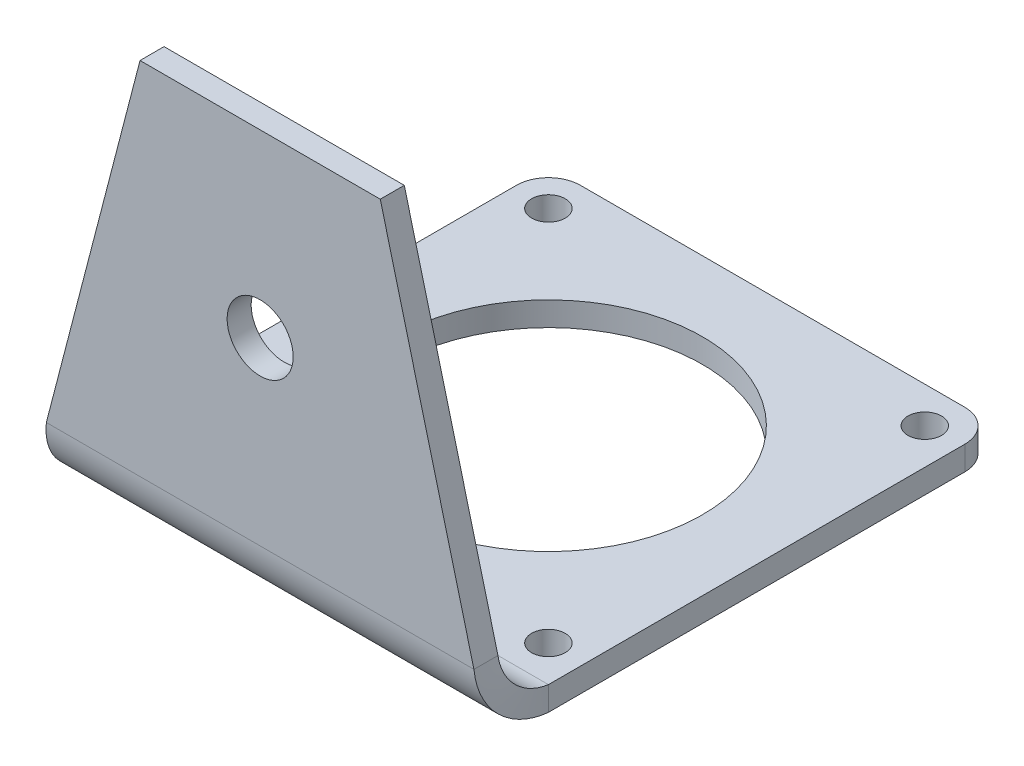
ISO-10303-21;
HEADER;
FILE_DESCRIPTION(('STEP AP214'),'2;1');
FILE_NAME('part.step','',(''),(''),'','','');
FILE_SCHEMA(('AUTOMOTIVE_DESIGN { 1 0 10303 214 1 1 1 1 }'));
ENDSEC;
DATA;
#1=APPLICATION_CONTEXT('core data for automotive mechanical design processes');
#2=APPLICATION_PROTOCOL_DEFINITION('international standard','automotive_design',2000,#1);
#3=PRODUCT_CONTEXT('',#1,'mechanical');
#4=PRODUCT('Part','Part','',(#3));
#5=PRODUCT_RELATED_PRODUCT_CATEGORY('part','',(#4));
#6=PRODUCT_DEFINITION_FORMATION('','',#4);
#7=PRODUCT_DEFINITION_CONTEXT('part definition',#1,'design');
#8=PRODUCT_DEFINITION('design','',#6,#7);
#9=PRODUCT_DEFINITION_SHAPE('','',#8);
#10=(LENGTH_UNIT() NAMED_UNIT(*) SI_UNIT(.MILLI.,.METRE.));
#11=(NAMED_UNIT(*) PLANE_ANGLE_UNIT() SI_UNIT($,.RADIAN.));
#12=(NAMED_UNIT(*) SI_UNIT($,.STERADIAN.) SOLID_ANGLE_UNIT());
#13=UNCERTAINTY_MEASURE_WITH_UNIT(LENGTH_MEASURE(1.E-05),#10,'distance_accuracy_value','');
#14=(GEOMETRIC_REPRESENTATION_CONTEXT(3) GLOBAL_UNCERTAINTY_ASSIGNED_CONTEXT((#13)) GLOBAL_UNIT_ASSIGNED_CONTEXT((#10,
#11,#12)) REPRESENTATION_CONTEXT('',''));
#15=CARTESIAN_POINT('',(0.,0.,0.));
#16=DIRECTION('',(0.,0.,1.));
#17=DIRECTION('',(1.,0.,0.));
#18=AXIS2_PLACEMENT_3D('',#15,#16,#17);
#19=CARTESIAN_POINT('',(-15.,50.0000000000001,36.));
#20=DIRECTION('',(0.967822506788272,-0.251633851764951,0.));
#21=DIRECTION('',(0.251633851764951,0.967822506788272,0.));
#22=AXIS2_PLACEMENT_3D('',#19,#20,#21);
#23=PLANE('',#22);
#24=CARTESIAN_POINT('',(-26.7,5.,36.));
#25=CARTESIAN_POINT('',(-26.7,5.,33.));
#26=B_SPLINE_CURVE_WITH_KNOTS('',1,(#24,#25),.UNSPECIFIED.,.F.,.F.,(2,2),(0.,1.),.UNSPECIFIED.);
#27=CARTESIAN_POINT('',(-26.7,5.,33.));
#28=VERTEX_POINT('',#27);
#29=CARTESIAN_POINT('',(-26.7,5.,36.));
#30=VERTEX_POINT('',#29);
#31=EDGE_CURVE('E197',#28,#30,#26,.F.);
#32=ORIENTED_EDGE('',*,*,#31,.T.);
#33=DIRECTION('',(0.251633851764951,0.967822506788272,0.));
#34=VECTOR('',#33,1.);
#35=CARTESIAN_POINT('',(-26.2270513300862,6.81903334582246,36.));
#36=LINE('',#35,#34);
#37=CARTESIAN_POINT('',(-15.,50.0000000000001,36.));
#38=VERTEX_POINT('',#37);
#39=EDGE_CURVE('E395',#38,#30,#36,.F.);
#40=ORIENTED_EDGE('',*,*,#39,.F.);
#41=DIRECTION('',(0.,0.,-1.));
#42=VECTOR('',#41,1.);
#43=CARTESIAN_POINT('',(-15.,50.0000000000001,36.));
#44=LINE('',#43,#42);
#45=CARTESIAN_POINT('',(-15.,50.,33.));
#46=VERTEX_POINT('',#45);
#47=EDGE_CURVE('E387',#38,#46,#44,.T.);
#48=ORIENTED_EDGE('',*,*,#47,.T.);
#49=DIRECTION('',(-0.251633851764951,-0.967822506788272,0.));
#50=VECTOR('',#49,1.);
#51=CARTESIAN_POINT('',(-15.,50.,33.));
#52=LINE('',#51,#50);
#53=EDGE_CURVE('E213',#46,#28,#52,.T.);
#54=ORIENTED_EDGE('',*,*,#53,.T.);
#55=EDGE_LOOP('',(#32,#40,#48,#54));
#56=FACE_BOUND('',#55,.T.);
#57=ADVANCED_FACE('F87',(#56),#23,.F.);
#58=CARTESIAN_POINT('',(28.,0.,36.));
#59=DIRECTION('',(-0.967822506788272,-0.251633851764951,0.));
#60=DIRECTION('',(0.251633851764951,-0.967822506788272,0.));
#61=AXIS2_PLACEMENT_3D('',#58,#59,#60);
#62=PLANE('',#61);
#63=CARTESIAN_POINT('',(26.7,5.,33.));
#64=CARTESIAN_POINT('',(26.7,5.,36.));
#65=B_SPLINE_CURVE_WITH_KNOTS('',1,(#63,#64),.UNSPECIFIED.,.F.,.F.,(2,2),(0.,1.),.UNSPECIFIED.);
#66=CARTESIAN_POINT('',(26.7,5.00000000000002,33.));
#67=VERTEX_POINT('',#66);
#68=CARTESIAN_POINT('',(26.7,5.00000000000005,36.));
#69=VERTEX_POINT('',#68);
#70=EDGE_CURVE('E13',#67,#69,#65,.T.);
#71=ORIENTED_EDGE('',*,*,#70,.F.);
#72=DIRECTION('',(-0.251633851764951,0.967822506788272,0.));
#73=VECTOR('',#72,1.);
#74=CARTESIAN_POINT('',(28.,0.,33.));
#75=LINE('',#74,#73);
#76=CARTESIAN_POINT('',(15.,50.,33.));
#77=VERTEX_POINT('',#76);
#78=EDGE_CURVE('E130',#67,#77,#75,.T.);
#79=ORIENTED_EDGE('',*,*,#78,.T.);
#80=DIRECTION('',(0.,0.,-1.));
#81=VECTOR('',#80,1.);
#82=CARTESIAN_POINT('',(15.,50.0000000000001,36.));
#83=LINE('',#82,#81);
#84=CARTESIAN_POINT('',(15.,50.0000000000001,36.));
#85=VERTEX_POINT('',#84);
#86=EDGE_CURVE('E384',#85,#77,#83,.T.);
#87=ORIENTED_EDGE('',*,*,#86,.F.);
#88=DIRECTION('',(0.251633851764951,-0.967822506788272,0.));
#89=VECTOR('',#88,1.);
#90=CARTESIAN_POINT('',(26.2270513300862,6.81903334582246,36.));
#91=LINE('',#90,#89);
#92=EDGE_CURVE('E218',#69,#85,#91,.F.);
#93=ORIENTED_EDGE('',*,*,#92,.F.);
#94=EDGE_LOOP('',(#71,#79,#87,#93));
#95=FACE_BOUND('',#94,.T.);
#96=ADVANCED_FACE('F217',(#95),#62,.F.);
#97=CARTESIAN_POINT('',(0.,0.,36.));
#98=DIRECTION('',(0.,0.,1.));
#99=DIRECTION('',(1.,0.,0.));
#100=AXIS2_PLACEMENT_3D('',#97,#98,#99);
#101=PLANE('',#100);
#102=CARTESIAN_POINT('',(0.,27.5000000000001,36.));
#103=DIRECTION('',(0.,0.,-1.));
#104=DIRECTION('',(-1.,0.,0.));
#105=AXIS2_PLACEMENT_3D('',#102,#103,#104);
#106=CIRCLE('',#105,4.125);
#107=CARTESIAN_POINT('',(-4.125,27.5000000000001,36.));
#108=VERTEX_POINT('',#107);
#109=EDGE_CURVE('E377',#108,#108,#106,.T.);
#110=ORIENTED_EDGE('',*,*,#109,.T.);
#111=EDGE_LOOP('',(#110));
#112=FACE_BOUND('',#111,.T.);
#113=ORIENTED_EDGE('',*,*,#39,.T.);
#114=DIRECTION('',(1.,0.,0.));
#115=VECTOR('',#114,1.);
#116=CARTESIAN_POINT('',(0.,5.00000000000005,36.));
#117=LINE('',#116,#115);
#118=EDGE_CURVE('E225',#30,#69,#117,.T.);
#119=ORIENTED_EDGE('',*,*,#118,.T.);
#120=ORIENTED_EDGE('',*,*,#92,.T.);
#121=DIRECTION('',(1.,0.,0.));
#122=VECTOR('',#121,1.);
#123=CARTESIAN_POINT('',(0.,50.0000000000001,36.));
#124=LINE('',#123,#122);
#125=EDGE_CURVE('E390',#85,#38,#124,.F.);
#126=ORIENTED_EDGE('',*,*,#125,.T.);
#127=EDGE_LOOP('',(#113,#119,#120,#126));
#128=FACE_BOUND('',#127,.T.);
#129=ADVANCED_FACE('F235',(#112,#128),#101,.T.);
#130=CARTESIAN_POINT('',(0.,0.,33.));
#131=DIRECTION('',(0.,0.,1.));
#132=DIRECTION('',(1.,0.,0.));
#133=AXIS2_PLACEMENT_3D('',#130,#131,#132);
#134=PLANE('',#133);
#135=CARTESIAN_POINT('',(0.,27.5000000000001,33.));
#136=DIRECTION('',(0.,0.,-1.));
#137=DIRECTION('',(-1.,0.,0.));
#138=AXIS2_PLACEMENT_3D('',#135,#136,#137);
#139=CIRCLE('',#138,4.125);
#140=CARTESIAN_POINT('',(-4.125,27.5000000000001,33.));
#141=VERTEX_POINT('',#140);
#142=EDGE_CURVE('E270',#141,#141,#139,.T.);
#143=ORIENTED_EDGE('',*,*,#142,.F.);
#144=EDGE_LOOP('',(#143));
#145=FACE_BOUND('',#144,.T.);
#146=DIRECTION('',(1.,0.,0.));
#147=VECTOR('',#146,1.);
#148=CARTESIAN_POINT('',(-26.7,5.00000000000004,33.));
#149=LINE('',#148,#147);
#150=EDGE_CURVE('E98',#28,#67,#149,.T.);
#151=ORIENTED_EDGE('',*,*,#150,.F.);
#152=ORIENTED_EDGE('',*,*,#53,.F.);
#153=DIRECTION('',(-1.,0.,0.));
#154=VECTOR('',#153,1.);
#155=CARTESIAN_POINT('',(-15.,50.,33.));
#156=LINE('',#155,#154);
#157=EDGE_CURVE('E122',#77,#46,#156,.T.);
#158=ORIENTED_EDGE('',*,*,#157,.F.);
#159=ORIENTED_EDGE('',*,*,#78,.F.);
#160=EDGE_LOOP('',(#151,#152,#158,#159));
#161=FACE_BOUND('',#160,.T.);
#162=ADVANCED_FACE('F211',(#145,#161),#134,.F.);
#163=CARTESIAN_POINT('',(-15.,50.0000000000001,36.));
#164=DIRECTION('',(0.,-1.,0.));
#165=DIRECTION('',(0.,0.,-1.));
#166=AXIS2_PLACEMENT_3D('',#163,#164,#165);
#167=PLANE('',#166);
#168=ORIENTED_EDGE('',*,*,#157,.T.);
#169=ORIENTED_EDGE('',*,*,#47,.F.);
#170=ORIENTED_EDGE('',*,*,#125,.F.);
#171=ORIENTED_EDGE('',*,*,#86,.T.);
#172=EDGE_LOOP('',(#168,#169,#170,#171));
#173=FACE_BOUND('',#172,.T.);
#174=ADVANCED_FACE('F236',(#173),#167,.F.);
#175=CARTESIAN_POINT('',(0.,27.5000000000001,36.));
#176=DIRECTION('',(0.,0.,-1.));
#177=DIRECTION('',(-1.,0.,0.));
#178=AXIS2_PLACEMENT_3D('',#175,#176,#177);
#179=CYLINDRICAL_SURFACE('',#178,4.125);
#180=ORIENTED_EDGE('',*,*,#109,.F.);
#181=EDGE_LOOP('',(#180));
#182=FACE_BOUND('',#181,.T.);
#183=ORIENTED_EDGE('',*,*,#142,.T.);
#184=EDGE_LOOP('',(#183));
#185=FACE_BOUND('',#184,.T.);
#186=ADVANCED_FACE('F239',(#182,#185),#179,.F.);
#187=CARTESIAN_POINT('',(24.,-3.,-24.));
#188=DIRECTION('',(0.,1.,0.));
#189=DIRECTION('',(0.,0.,1.));
#190=AXIS2_PLACEMENT_3D('',#187,#188,#189);
#191=CYLINDRICAL_SURFACE('',#190,4.);
#192=CARTESIAN_POINT('',(24.,0.,-24.));
#193=DIRECTION('',(0.,1.,0.));
#194=DIRECTION('',(0.,0.,-1.));
#195=AXIS2_PLACEMENT_3D('',#192,#193,#194);
#196=CIRCLE('',#195,4.);
#197=CARTESIAN_POINT('',(28.,0.,-24.));
#198=VERTEX_POINT('',#197);
#199=CARTESIAN_POINT('',(24.,0.,-28.));
#200=VERTEX_POINT('',#199);
#201=EDGE_CURVE('E284',#198,#200,#196,.T.);
#202=ORIENTED_EDGE('',*,*,#201,.F.);
#203=DIRECTION('',(0.,1.,0.));
#204=VECTOR('',#203,1.);
#205=CARTESIAN_POINT('',(28.,-3.,-24.));
#206=LINE('',#205,#204);
#207=CARTESIAN_POINT('',(28.,-3.,-24.));
#208=VERTEX_POINT('',#207);
#209=EDGE_CURVE('E138',#208,#198,#206,.T.);
#210=ORIENTED_EDGE('',*,*,#209,.F.);
#211=CARTESIAN_POINT('',(24.,-3.,-24.));
#212=DIRECTION('',(0.,1.,0.));
#213=DIRECTION('',(0.,0.,-1.));
#214=AXIS2_PLACEMENT_3D('',#211,#212,#213);
#215=CIRCLE('',#214,4.);
#216=CARTESIAN_POINT('',(24.,-3.,-28.));
#217=VERTEX_POINT('',#216);
#218=EDGE_CURVE('E370',#208,#217,#215,.T.);
#219=ORIENTED_EDGE('',*,*,#218,.T.);
#220=DIRECTION('',(0.,1.,0.));
#221=VECTOR('',#220,1.);
#222=CARTESIAN_POINT('',(24.,-3.,-28.));
#223=LINE('',#222,#221);
#224=EDGE_CURVE('E367',#217,#200,#223,.T.);
#225=ORIENTED_EDGE('',*,*,#224,.T.);
#226=EDGE_LOOP('',(#202,#210,#219,#225));
#227=FACE_BOUND('',#226,.T.);
#228=ADVANCED_FACE('F248',(#227),#191,.T.);
#229=CARTESIAN_POINT('',(-24.,-3.,-28.));
#230=DIRECTION('',(0.,0.,-1.));
#231=DIRECTION('',(-1.,0.,0.));
#232=AXIS2_PLACEMENT_3D('',#229,#230,#231);
#233=PLANE('',#232);
#234=DIRECTION('',(-1.,0.,0.));
#235=VECTOR('',#234,1.);
#236=CARTESIAN_POINT('',(-24.,0.,-28.));
#237=LINE('',#236,#235);
#238=CARTESIAN_POINT('',(-24.,0.,-28.));
#239=VERTEX_POINT('',#238);
#240=EDGE_CURVE('E280',#200,#239,#237,.T.);
#241=ORIENTED_EDGE('',*,*,#240,.F.);
#242=ORIENTED_EDGE('',*,*,#224,.F.);
#243=DIRECTION('',(-1.,0.,0.));
#244=VECTOR('',#243,1.);
#245=CARTESIAN_POINT('',(-24.,-3.,-28.));
#246=LINE('',#245,#244);
#247=CARTESIAN_POINT('',(-24.,-3.,-28.));
#248=VERTEX_POINT('',#247);
#249=EDGE_CURVE('E363',#217,#248,#246,.T.);
#250=ORIENTED_EDGE('',*,*,#249,.T.);
#251=DIRECTION('',(0.,1.,0.));
#252=VECTOR('',#251,1.);
#253=CARTESIAN_POINT('',(-24.,-3.,-28.));
#254=LINE('',#253,#252);
#255=EDGE_CURVE('E360',#248,#239,#254,.T.);
#256=ORIENTED_EDGE('',*,*,#255,.T.);
#257=EDGE_LOOP('',(#241,#242,#250,#256));
#258=FACE_BOUND('',#257,.T.);
#259=ADVANCED_FACE('F541',(#258),#233,.T.);
#260=CARTESIAN_POINT('',(-24.,-3.,-24.));
#261=DIRECTION('',(0.,1.,0.));
#262=DIRECTION('',(0.,0.,1.));
#263=AXIS2_PLACEMENT_3D('',#260,#261,#262);
#264=CYLINDRICAL_SURFACE('',#263,4.);
#265=CARTESIAN_POINT('',(-24.,0.,-24.));
#266=DIRECTION('',(0.,1.,0.));
#267=DIRECTION('',(0.,0.,-1.));
#268=AXIS2_PLACEMENT_3D('',#265,#266,#267);
#269=CIRCLE('',#268,4.);
#270=CARTESIAN_POINT('',(-28.,0.,-24.));
#271=VERTEX_POINT('',#270);
#272=EDGE_CURVE('E274',#239,#271,#269,.T.);
#273=ORIENTED_EDGE('',*,*,#272,.F.);
#274=ORIENTED_EDGE('',*,*,#255,.F.);
#275=CARTESIAN_POINT('',(-24.,-3.,-24.));
#276=DIRECTION('',(0.,1.,0.));
#277=DIRECTION('',(0.,0.,-1.));
#278=AXIS2_PLACEMENT_3D('',#275,#276,#277);
#279=CIRCLE('',#278,4.);
#280=CARTESIAN_POINT('',(-28.,-3.,-24.));
#281=VERTEX_POINT('',#280);
#282=EDGE_CURVE('E356',#248,#281,#279,.T.);
#283=ORIENTED_EDGE('',*,*,#282,.T.);
#284=DIRECTION('',(0.,1.,0.));
#285=VECTOR('',#284,1.);
#286=CARTESIAN_POINT('',(-28.,-3.,-24.));
#287=LINE('',#286,#285);
#288=EDGE_CURVE('E353',#281,#271,#287,.T.);
#289=ORIENTED_EDGE('',*,*,#288,.T.);
#290=EDGE_LOOP('',(#273,#274,#283,#289));
#291=FACE_BOUND('',#290,.T.);
#292=ADVANCED_FACE('F537',(#291),#264,.T.);
#293=CARTESIAN_POINT('',(-23.5,0.,23.5));
#294=DIRECTION('',(0.,1.,0.));
#295=DIRECTION('',(0.,0.,1.));
#296=AXIS2_PLACEMENT_3D('',#293,#294,#295);
#297=CYLINDRICAL_SURFACE('',#296,2.1);
#298=CARTESIAN_POINT('',(-23.5,-3.,23.5));
#299=DIRECTION('',(0.,1.,0.));
#300=DIRECTION('',(0.,0.,1.));
#301=AXIS2_PLACEMENT_3D('',#298,#299,#300);
#302=CIRCLE('',#301,2.1);
#303=CARTESIAN_POINT('',(-23.5,-3.,25.6));
#304=VERTEX_POINT('',#303);
#305=EDGE_CURVE('E311',#304,#304,#302,.T.);
#306=ORIENTED_EDGE('',*,*,#305,.F.);
#307=EDGE_LOOP('',(#306));
#308=FACE_BOUND('',#307,.T.);
#309=CARTESIAN_POINT('',(-23.5,0.,23.5));
#310=DIRECTION('',(0.,1.,0.));
#311=DIRECTION('',(0.,0.,1.));
#312=AXIS2_PLACEMENT_3D('',#309,#310,#311);
#313=CIRCLE('',#312,2.1);
#314=CARTESIAN_POINT('',(-23.5,0.,25.6));
#315=VERTEX_POINT('',#314);
#316=EDGE_CURVE('E349',#315,#315,#313,.T.);
#317=ORIENTED_EDGE('',*,*,#316,.T.);
#318=EDGE_LOOP('',(#317));
#319=FACE_BOUND('',#318,.T.);
#320=ADVANCED_FACE('F533',(#308,#319),#297,.F.);
#321=CARTESIAN_POINT('',(23.5,0.,23.5));
#322=DIRECTION('',(0.,1.,0.));
#323=DIRECTION('',(0.,0.,1.));
#324=AXIS2_PLACEMENT_3D('',#321,#322,#323);
#325=CYLINDRICAL_SURFACE('',#324,2.1);
#326=CARTESIAN_POINT('',(23.5,-3.,23.5));
#327=DIRECTION('',(0.,1.,0.));
#328=DIRECTION('',(0.,0.,1.));
#329=AXIS2_PLACEMENT_3D('',#326,#327,#328);
#330=CIRCLE('',#329,2.1);
#331=CARTESIAN_POINT('',(23.5,-3.,25.6));
#332=VERTEX_POINT('',#331);
#333=EDGE_CURVE('E317',#332,#332,#330,.T.);
#334=ORIENTED_EDGE('',*,*,#333,.F.);
#335=EDGE_LOOP('',(#334));
#336=FACE_BOUND('',#335,.T.);
#337=CARTESIAN_POINT('',(23.5,0.,23.5));
#338=DIRECTION('',(0.,1.,0.));
#339=DIRECTION('',(0.,0.,1.));
#340=AXIS2_PLACEMENT_3D('',#337,#338,#339);
#341=CIRCLE('',#340,2.1);
#342=CARTESIAN_POINT('',(23.5,0.,25.6));
#343=VERTEX_POINT('',#342);
#344=EDGE_CURVE('E345',#343,#343,#341,.T.);
#345=ORIENTED_EDGE('',*,*,#344,.T.);
#346=EDGE_LOOP('',(#345));
#347=FACE_BOUND('',#346,.T.);
#348=ADVANCED_FACE('F529',(#336,#347),#325,.F.);
#349=CARTESIAN_POINT('',(23.4961605692781,0.,-23.5));
#350=DIRECTION('',(0.,1.,0.));
#351=DIRECTION('',(0.,0.,1.));
#352=AXIS2_PLACEMENT_3D('',#349,#350,#351);
#353=CYLINDRICAL_SURFACE('',#352,2.1);
#354=CARTESIAN_POINT('',(23.4961605692781,-3.,-23.5));
#355=DIRECTION('',(0.,1.,0.));
#356=DIRECTION('',(0.,0.,1.));
#357=AXIS2_PLACEMENT_3D('',#354,#355,#356);
#358=CIRCLE('',#357,2.1);
#359=CARTESIAN_POINT('',(23.4961605692781,-3.,-21.4));
#360=VERTEX_POINT('',#359);
#361=EDGE_CURVE('E321',#360,#360,#358,.T.);
#362=ORIENTED_EDGE('',*,*,#361,.F.);
#363=EDGE_LOOP('',(#362));
#364=FACE_BOUND('',#363,.T.);
#365=CARTESIAN_POINT('',(23.4961605692781,0.,-23.5));
#366=DIRECTION('',(0.,1.,0.));
#367=DIRECTION('',(0.,0.,1.));
#368=AXIS2_PLACEMENT_3D('',#365,#366,#367);
#369=CIRCLE('',#368,2.1);
#370=CARTESIAN_POINT('',(23.4961605692781,0.,-21.4));
#371=VERTEX_POINT('',#370);
#372=EDGE_CURVE('E341',#371,#371,#369,.T.);
#373=ORIENTED_EDGE('',*,*,#372,.T.);
#374=EDGE_LOOP('',(#373));
#375=FACE_BOUND('',#374,.T.);
#376=ADVANCED_FACE('F525',(#364,#375),#353,.F.);
#377=CARTESIAN_POINT('',(-23.5,0.,-23.5));
#378=DIRECTION('',(0.,1.,0.));
#379=DIRECTION('',(0.,0.,1.));
#380=AXIS2_PLACEMENT_3D('',#377,#378,#379);
#381=CYLINDRICAL_SURFACE('',#380,2.1);
#382=CARTESIAN_POINT('',(-23.5,-3.,-23.5));
#383=DIRECTION('',(0.,1.,0.));
#384=DIRECTION('',(0.,0.,1.));
#385=AXIS2_PLACEMENT_3D('',#382,#383,#384);
#386=CIRCLE('',#385,2.1);
#387=CARTESIAN_POINT('',(-23.5,-3.,-21.4));
#388=VERTEX_POINT('',#387);
#389=EDGE_CURVE('E325',#388,#388,#386,.T.);
#390=ORIENTED_EDGE('',*,*,#389,.F.);
#391=EDGE_LOOP('',(#390));
#392=FACE_BOUND('',#391,.T.);
#393=CARTESIAN_POINT('',(-23.5,0.,-23.5));
#394=DIRECTION('',(0.,1.,0.));
#395=DIRECTION('',(0.,0.,1.));
#396=AXIS2_PLACEMENT_3D('',#393,#394,#395);
#397=CIRCLE('',#396,2.1);
#398=CARTESIAN_POINT('',(-23.5,0.,-21.4));
#399=VERTEX_POINT('',#398);
#400=EDGE_CURVE('E337',#399,#399,#397,.T.);
#401=ORIENTED_EDGE('',*,*,#400,.T.);
#402=EDGE_LOOP('',(#401));
#403=FACE_BOUND('',#402,.T.);
#404=ADVANCED_FACE('F521',(#392,#403),#381,.F.);
#405=CARTESIAN_POINT('',(0.,-3.,0.));
#406=DIRECTION('',(0.,1.,0.));
#407=DIRECTION('',(0.,0.,1.));
#408=AXIS2_PLACEMENT_3D('',#405,#406,#407);
#409=CYLINDRICAL_SURFACE('',#408,19.25);
#410=CARTESIAN_POINT('',(0.,-3.,0.));
#411=DIRECTION('',(0.,1.,0.));
#412=DIRECTION('',(0.,0.,1.));
#413=AXIS2_PLACEMENT_3D('',#410,#411,#412);
#414=CIRCLE('',#413,19.25);
#415=CARTESIAN_POINT('',(0.,-3.,19.25));
#416=VERTEX_POINT('',#415);
#417=EDGE_CURVE('E329',#416,#416,#414,.T.);
#418=ORIENTED_EDGE('',*,*,#417,.F.);
#419=EDGE_LOOP('',(#418));
#420=FACE_BOUND('',#419,.T.);
#421=CARTESIAN_POINT('',(0.,0.,0.));
#422=DIRECTION('',(0.,1.,0.));
#423=DIRECTION('',(0.,0.,1.));
#424=AXIS2_PLACEMENT_3D('',#421,#422,#423);
#425=CIRCLE('',#424,19.25);
#426=CARTESIAN_POINT('',(0.,0.,19.25));
#427=VERTEX_POINT('',#426);
#428=EDGE_CURVE('E333',#427,#427,#425,.T.);
#429=ORIENTED_EDGE('',*,*,#428,.T.);
#430=EDGE_LOOP('',(#429));
#431=FACE_BOUND('',#430,.T.);
#432=ADVANCED_FACE('F517',(#420,#431),#409,.F.);
#433=CARTESIAN_POINT('',(-24.,-3.,-24.));
#434=DIRECTION('',(0.,-1.,0.));
#435=DIRECTION('',(0.,0.,-1.));
#436=AXIS2_PLACEMENT_3D('',#433,#434,#435);
#437=PLANE('',#436);
#438=ORIENTED_EDGE('',*,*,#417,.T.);
#439=EDGE_LOOP('',(#438));
#440=FACE_BOUND('',#439,.T.);
#441=ORIENTED_EDGE('',*,*,#389,.T.);
#442=EDGE_LOOP('',(#441));
#443=FACE_BOUND('',#442,.T.);
#444=ORIENTED_EDGE('',*,*,#361,.T.);
#445=EDGE_LOOP('',(#444));
#446=FACE_BOUND('',#445,.T.);
#447=ORIENTED_EDGE('',*,*,#333,.T.);
#448=EDGE_LOOP('',(#447));
#449=FACE_BOUND('',#448,.T.);
#450=ORIENTED_EDGE('',*,*,#305,.T.);
#451=EDGE_LOOP('',(#450));
#452=FACE_BOUND('',#451,.T.);
#453=DIRECTION('',(0.,0.,1.));
#454=VECTOR('',#453,1.);
#455=CARTESIAN_POINT('',(-28.,-3.,28.));
#456=LINE('',#455,#454);
#457=CARTESIAN_POINT('',(-28.,-3.,28.));
#458=VERTEX_POINT('',#457);
#459=EDGE_CURVE('E307',#281,#458,#456,.T.);
#460=ORIENTED_EDGE('',*,*,#459,.F.);
#461=ORIENTED_EDGE('',*,*,#282,.F.);
#462=ORIENTED_EDGE('',*,*,#249,.F.);
#463=ORIENTED_EDGE('',*,*,#218,.F.);
#464=DIRECTION('',(0.,0.,-1.));
#465=VECTOR('',#464,1.);
#466=CARTESIAN_POINT('',(28.,-3.,28.));
#467=LINE('',#466,#465);
#468=CARTESIAN_POINT('',(28.,-3.,28.));
#469=VERTEX_POINT('',#468);
#470=EDGE_CURVE('E271',#469,#208,#467,.T.);
#471=ORIENTED_EDGE('',*,*,#470,.F.);
#472=DIRECTION('',(1.,0.,0.));
#473=VECTOR('',#472,1.);
#474=CARTESIAN_POINT('',(-28.,-3.,28.));
#475=LINE('',#474,#473);
#476=EDGE_CURVE('E177',#458,#469,#475,.T.);
#477=ORIENTED_EDGE('',*,*,#476,.F.);
#478=EDGE_LOOP('',(#460,#461,#462,#463,#471,#477));
#479=FACE_BOUND('',#478,.T.);
#480=ADVANCED_FACE('F514',(#440,#443,#446,#449,#452,#479),#437,.T.);
#481=CARTESIAN_POINT('',(-28.,-3.,28.));
#482=DIRECTION('',(-1.,0.,0.));
#483=DIRECTION('',(0.,0.,1.));
#484=AXIS2_PLACEMENT_3D('',#481,#482,#483);
#485=PLANE('',#484);
#486=DIRECTION('',(0.,0.,1.));
#487=VECTOR('',#486,1.);
#488=CARTESIAN_POINT('',(-28.,0.,28.));
#489=LINE('',#488,#487);
#490=CARTESIAN_POINT('',(-28.,0.,28.));
#491=VERTEX_POINT('',#490);
#492=EDGE_CURVE('E298',#271,#491,#489,.T.);
#493=ORIENTED_EDGE('',*,*,#492,.F.);
#494=ORIENTED_EDGE('',*,*,#288,.F.);
#495=ORIENTED_EDGE('',*,*,#459,.T.);
#496=CARTESIAN_POINT('',(-28.,0.,28.));
#497=CARTESIAN_POINT('',(-28.,-3.,28.));
#498=B_SPLINE_CURVE_WITH_KNOTS('',1,(#496,#497),.UNSPECIFIED.,.F.,.F.,(2,2),(0.,1.),.UNSPECIFIED.);
#499=EDGE_CURVE('E304',#458,#491,#498,.F.);
#500=ORIENTED_EDGE('',*,*,#499,.T.);
#501=EDGE_LOOP('',(#493,#494,#495,#500));
#502=FACE_BOUND('',#501,.T.);
#503=ADVANCED_FACE('F505',(#502),#485,.T.);
#504=CARTESIAN_POINT('',(-24.,0.,-24.));
#505=DIRECTION('',(0.,-1.,0.));
#506=DIRECTION('',(0.,0.,-1.));
#507=AXIS2_PLACEMENT_3D('',#504,#505,#506);
#508=PLANE('',#507);
#509=ORIENTED_EDGE('',*,*,#428,.F.);
#510=EDGE_LOOP('',(#509));
#511=FACE_BOUND('',#510,.T.);
#512=ORIENTED_EDGE('',*,*,#400,.F.);
#513=EDGE_LOOP('',(#512));
#514=FACE_BOUND('',#513,.T.);
#515=ORIENTED_EDGE('',*,*,#372,.F.);
#516=EDGE_LOOP('',(#515));
#517=FACE_BOUND('',#516,.T.);
#518=ORIENTED_EDGE('',*,*,#344,.F.);
#519=EDGE_LOOP('',(#518));
#520=FACE_BOUND('',#519,.T.);
#521=ORIENTED_EDGE('',*,*,#316,.F.);
#522=EDGE_LOOP('',(#521));
#523=FACE_BOUND('',#522,.T.);
#524=ORIENTED_EDGE('',*,*,#492,.T.);
#525=DIRECTION('',(1.,0.,0.));
#526=VECTOR('',#525,1.);
#527=CARTESIAN_POINT('',(-28.,0.,28.));
#528=LINE('',#527,#526);
#529=CARTESIAN_POINT('',(28.,0.,28.));
#530=VERTEX_POINT('',#529);
#531=EDGE_CURVE('E292',#491,#530,#528,.T.);
#532=ORIENTED_EDGE('',*,*,#531,.T.);
#533=DIRECTION('',(0.,0.,-1.));
#534=VECTOR('',#533,1.);
#535=CARTESIAN_POINT('',(28.,0.,28.));
#536=LINE('',#535,#534);
#537=EDGE_CURVE('E288',#530,#198,#536,.T.);
#538=ORIENTED_EDGE('',*,*,#537,.T.);
#539=ORIENTED_EDGE('',*,*,#201,.T.);
#540=ORIENTED_EDGE('',*,*,#240,.T.);
#541=ORIENTED_EDGE('',*,*,#272,.T.);
#542=EDGE_LOOP('',(#524,#532,#538,#539,#540,#541));
#543=FACE_BOUND('',#542,.T.);
#544=ADVANCED_FACE('F255',(#511,#514,#517,#520,#523,#543),#508,.F.);
#545=CARTESIAN_POINT('',(28.,-3.,28.));
#546=DIRECTION('',(1.,0.,0.));
#547=DIRECTION('',(0.,0.,-1.));
#548=AXIS2_PLACEMENT_3D('',#545,#546,#547);
#549=PLANE('',#548);
#550=ORIENTED_EDGE('',*,*,#537,.F.);
#551=CARTESIAN_POINT('',(28.,-3.,28.));
#552=CARTESIAN_POINT('',(28.,0.,28.));
#553=B_SPLINE_CURVE_WITH_KNOTS('',1,(#551,#552),.UNSPECIFIED.,.F.,.F.,(2,2),(0.,1.),.UNSPECIFIED.);
#554=EDGE_CURVE('E205',#469,#530,#553,.T.);
#555=ORIENTED_EDGE('',*,*,#554,.F.);
#556=ORIENTED_EDGE('',*,*,#470,.T.);
#557=ORIENTED_EDGE('',*,*,#209,.T.);
#558=EDGE_LOOP('',(#550,#555,#556,#557));
#559=FACE_BOUND('',#558,.T.);
#560=ADVANCED_FACE('F250',(#559),#549,.T.);
#561=CARTESIAN_POINT('',(-26.7,5.,36.));
#562=CARTESIAN_POINT('',(-26.8083526587171,3.95261564116114,36.));
#563=CARTESIAN_POINT('',(-26.9166666666667,2.90601692512575,35.7917814133465));
#564=CARTESIAN_POINT('',(-27.1333333333333,0.971048157032801,34.9902911068341));
#565=CARTESIAN_POINT('',(-27.2416666666667,0.0836262402006793,34.3973347391854));
#566=CARTESIAN_POINT('',(-27.4583333333333,-1.39733473918544,32.9163737597993));
#567=CARTESIAN_POINT('',(-27.5666666666667,-1.99029110683406,32.0289518429672));
#568=CARTESIAN_POINT('',(-27.7833333333333,-2.79178141334652,30.0939830748742));
#569=CARTESIAN_POINT('',(-27.8916473412829,-3.,29.0473843588389));
#570=CARTESIAN_POINT('',(-28.,-3.,28.));
#571=CARTESIAN_POINT('',(-26.7,5.,33.));
#572=CARTESIAN_POINT('',(-26.8083523446798,4.34538667299,33.));
#573=CARTESIAN_POINT('',(-26.9166666666667,3.6912605782036,32.8698633833416));
#574=CARTESIAN_POINT('',(-27.1333333333333,2.4819050981455,32.3689319417713));
#575=CARTESIAN_POINT('',(-27.2416666666667,1.92726640012542,31.9983342119909));
#576=CARTESIAN_POINT('',(-27.4583333333333,1.0016657880091,31.0727335998746));
#577=CARTESIAN_POINT('',(-27.5666666666667,0.631068058228711,30.5180949018545));
#578=CARTESIAN_POINT('',(-27.7833333333333,0.130136616658422,29.3087394217964));
#579=CARTESIAN_POINT('',(-27.8916476553202,0.,28.65461332701));
#580=CARTESIAN_POINT('',(-28.,0.,28.));
#581=B_SPLINE_SURFACE_WITH_KNOTS('',1,3,((#561,#562,#563,#564,#565,#566,#567,#568,#569,#570),
(#571,#572,#573,#574,#575,#576,#577,#578,#579,#580)),.UNSPECIFIED.,.F.,.F.,.F.,(2,2),(4,2,2,2,
4),(0.,1.),(0.,0.25,0.5,0.75,1.),.UNSPECIFIED.);
#582=CARTESIAN_POINT('',(-26.7,5.,33.));
#583=CARTESIAN_POINT('',(-26.8083523446798,4.34538667299,33.));
#584=CARTESIAN_POINT('',(-26.9166666666667,3.6912605782036,32.8698633833416));
#585=CARTESIAN_POINT('',(-27.1333333333333,2.4819050981455,32.3689319417713));
#586=CARTESIAN_POINT('',(-27.2416666666667,1.92726640012542,31.9983342119909));
#587=CARTESIAN_POINT('',(-27.4583333333333,1.0016657880091,31.0727335998746));
#588=CARTESIAN_POINT('',(-27.5666666666667,0.631068058228711,30.5180949018545));
#589=CARTESIAN_POINT('',(-27.7833333333333,0.130136616658422,29.3087394217964));
#590=CARTESIAN_POINT('',(-27.8916476553202,0.,28.65461332701));
#591=CARTESIAN_POINT('',(-28.,0.,28.));
#592=B_SPLINE_CURVE_WITH_KNOTS('',3,(#582,#583,#584,#585,#586,#587,#588,#589,#590,#591),
.UNSPECIFIED.,.F.,.F.,(4,2,2,2,4),(0.,0.25,0.5,0.75,1.),.UNSPECIFIED.);
#593=EDGE_CURVE('E170',#28,#491,#592,.T.);
#594=CARTESIAN_POINT('',(-28.,-3.,28.));
#595=CARTESIAN_POINT('',(-27.8916473412829,-3.,29.0473843588389));
#596=CARTESIAN_POINT('',(-27.7833333333333,-2.79178141334652,30.0939830748742));
#597=CARTESIAN_POINT('',(-27.5666666666667,-1.99029110683406,32.0289518429672));
#598=CARTESIAN_POINT('',(-27.4583333333333,-1.39733473918544,32.9163737597993));
#599=CARTESIAN_POINT('',(-27.2416666666667,0.0836262402006793,34.3973347391854));
#600=CARTESIAN_POINT('',(-27.1333333333333,0.971048157032801,34.9902911068341));
#601=CARTESIAN_POINT('',(-26.9166666666667,2.90601692512575,35.7917814133465));
#602=CARTESIAN_POINT('',(-26.8083526587171,3.95261564116114,36.));
#603=CARTESIAN_POINT('',(-26.7,5.,36.));
#604=B_SPLINE_CURVE_WITH_KNOTS('',3,(#594,#595,#596,#597,#598,#599,#600,#601,#602,#603),
.UNSPECIFIED.,.F.,.F.,(4,2,2,2,4),(0.,0.25,0.5,0.75,1.),.UNSPECIFIED.);
#605=EDGE_CURVE('E208',#30,#458,#604,.F.);
#606=ORIENTED_EDGE('',*,*,#31,.F.);
#607=ORIENTED_EDGE('',*,*,#593,.T.);
#608=ORIENTED_EDGE('',*,*,#499,.F.);
#609=ORIENTED_EDGE('',*,*,#605,.F.);
#610=EDGE_LOOP('',(#606,#607,#608,#609));
#611=FACE_BOUND('',#610,.T.);
#612=ADVANCED_FACE('F254',(#611),#581,.T.);
#613=CARTESIAN_POINT('',(28.,-3.,28.));
#614=CARTESIAN_POINT('',(27.8916473412829,-3.,29.0473843588389));
#615=CARTESIAN_POINT('',(27.7833333333333,-2.79178141334652,30.0939830748742));
#616=CARTESIAN_POINT('',(27.5666666666667,-1.99029110683406,32.0289518429672));
#617=CARTESIAN_POINT('',(27.4583333333333,-1.39733473918544,32.9163737597993));
#618=CARTESIAN_POINT('',(27.2416666666667,0.0836262402006793,34.3973347391854));
#619=CARTESIAN_POINT('',(27.1333333333333,0.971048157032801,34.9902911068341));
#620=CARTESIAN_POINT('',(26.9166666666667,2.90601692512575,35.7917814133465));
#621=CARTESIAN_POINT('',(26.8083526587171,3.95261564116114,36.));
#622=CARTESIAN_POINT('',(26.7,5.,36.));
#623=CARTESIAN_POINT('',(28.,0.,28.));
#624=CARTESIAN_POINT('',(27.8916476553202,0.,28.65461332701));
#625=CARTESIAN_POINT('',(27.7833333333333,0.130136616658422,29.3087394217964));
#626=CARTESIAN_POINT('',(27.5666666666667,0.631068058228711,30.5180949018545));
#627=CARTESIAN_POINT('',(27.4583333333333,1.0016657880091,31.0727335998746));
#628=CARTESIAN_POINT('',(27.2416666666667,1.92726640012542,31.9983342119909));
#629=CARTESIAN_POINT('',(27.1333333333333,2.4819050981455,32.3689319417713));
#630=CARTESIAN_POINT('',(26.9166666666667,3.6912605782036,32.8698633833416));
#631=CARTESIAN_POINT('',(26.8083523446798,4.34538667299001,33.));
#632=CARTESIAN_POINT('',(26.7,5.,33.));
#633=B_SPLINE_SURFACE_WITH_KNOTS('',1,3,((#613,#614,#615,#616,#617,#618,#619,#620,#621,#622),
(#623,#624,#625,#626,#627,#628,#629,#630,#631,#632)),.UNSPECIFIED.,.F.,.F.,.F.,(2,2),(4,2,2,2,
4),(0.,1.),(0.,0.25,0.5,0.75,1.),.UNSPECIFIED.);
#634=CARTESIAN_POINT('',(28.,0.,28.));
#635=CARTESIAN_POINT('',(27.8916476553202,0.,28.65461332701));
#636=CARTESIAN_POINT('',(27.7833333333333,0.130136616658422,29.3087394217964));
#637=CARTESIAN_POINT('',(27.5666666666667,0.631068058228711,30.5180949018545));
#638=CARTESIAN_POINT('',(27.4583333333333,1.0016657880091,31.0727335998746));
#639=CARTESIAN_POINT('',(27.2416666666667,1.92726640012542,31.9983342119909));
#640=CARTESIAN_POINT('',(27.1333333333333,2.4819050981455,32.3689319417713));
#641=CARTESIAN_POINT('',(26.9166666666667,3.6912605782036,32.8698633833416));
#642=CARTESIAN_POINT('',(26.8083523446798,4.34538667299001,33.));
#643=CARTESIAN_POINT('',(26.7,5.,33.));
#644=B_SPLINE_CURVE_WITH_KNOTS('',3,(#634,#635,#636,#637,#638,#639,#640,#641,#642,#643),
.UNSPECIFIED.,.F.,.F.,(4,2,2,2,4),(0.,0.25,0.5,0.75,1.),.UNSPECIFIED.);
#645=EDGE_CURVE('E190',#530,#67,#644,.T.);
#646=CARTESIAN_POINT('',(26.7,5.,36.));
#647=CARTESIAN_POINT('',(26.8083526587171,3.95261564116114,36.));
#648=CARTESIAN_POINT('',(26.9166666666667,2.90601692512575,35.7917814133465));
#649=CARTESIAN_POINT('',(27.1333333333333,0.971048157032801,34.9902911068341));
#650=CARTESIAN_POINT('',(27.2416666666667,0.0836262402006793,34.3973347391854));
#651=CARTESIAN_POINT('',(27.4583333333333,-1.39733473918544,32.9163737597993));
#652=CARTESIAN_POINT('',(27.5666666666667,-1.99029110683406,32.0289518429672));
#653=CARTESIAN_POINT('',(27.7833333333333,-2.79178141334652,30.0939830748742));
#654=CARTESIAN_POINT('',(27.8916473412829,-3.,29.0473843588389));
#655=CARTESIAN_POINT('',(28.,-3.,28.));
#656=B_SPLINE_CURVE_WITH_KNOTS('',3,(#646,#647,#648,#649,#650,#651,#652,#653,#654,#655),
.UNSPECIFIED.,.F.,.F.,(4,2,2,2,4),(0.,0.25,0.5,0.75,1.),.UNSPECIFIED.);
#657=EDGE_CURVE('E106',#469,#69,#656,.F.);
#658=ORIENTED_EDGE('',*,*,#645,.T.);
#659=ORIENTED_EDGE('',*,*,#70,.T.);
#660=ORIENTED_EDGE('',*,*,#657,.F.);
#661=ORIENTED_EDGE('',*,*,#554,.T.);
#662=EDGE_LOOP('',(#658,#659,#660,#661));
#663=FACE_BOUND('',#662,.T.);
#664=ADVANCED_FACE('F201',(#663),#633,.T.);
#665=CARTESIAN_POINT('',(57.0021727347871,5.,28.));
#666=DIRECTION('',(-1.,0.,0.));
#667=DIRECTION('',(0.,0.,1.));
#668=AXIS2_PLACEMENT_3D('',#665,#666,#667);
#669=CYLINDRICAL_SURFACE('',#668,8.);
#670=ORIENTED_EDGE('',*,*,#476,.T.);
#671=ORIENTED_EDGE('',*,*,#657,.T.);
#672=ORIENTED_EDGE('',*,*,#118,.F.);
#673=ORIENTED_EDGE('',*,*,#605,.T.);
#674=EDGE_LOOP('',(#670,#671,#672,#673));
#675=FACE_BOUND('',#674,.T.);
#676=ADVANCED_FACE('F425',(#675),#669,.T.);
#677=CARTESIAN_POINT('',(57.0021727347871,5.,28.));
#678=DIRECTION('',(-1.,0.,0.));
#679=DIRECTION('',(0.,0.,1.));
#680=AXIS2_PLACEMENT_3D('',#677,#678,#679);
#681=CYLINDRICAL_SURFACE('',#680,5.);
#682=ORIENTED_EDGE('',*,*,#531,.F.);
#683=ORIENTED_EDGE('',*,*,#593,.F.);
#684=ORIENTED_EDGE('',*,*,#150,.T.);
#685=ORIENTED_EDGE('',*,*,#645,.F.);
#686=EDGE_LOOP('',(#682,#683,#684,#685));
#687=FACE_BOUND('',#686,.T.);
#688=ADVANCED_FACE('F189',(#687),#681,.F.);
#689=CLOSED_SHELL('',(#57,#96,#129,#162,#174,#186,#228,#259,#292,#320,#348,#376,#404,#432,#480,
#503,#544,#560,#612,#664,#676,#688));
#690=MANIFOLD_SOLID_BREP('B2',#689);
#691=ADVANCED_BREP_SHAPE_REPRESENTATION('',(#18,#690),#14);
#692=SHAPE_DEFINITION_REPRESENTATION(#9,#691);
ENDSEC;
END-ISO-10303-21;
